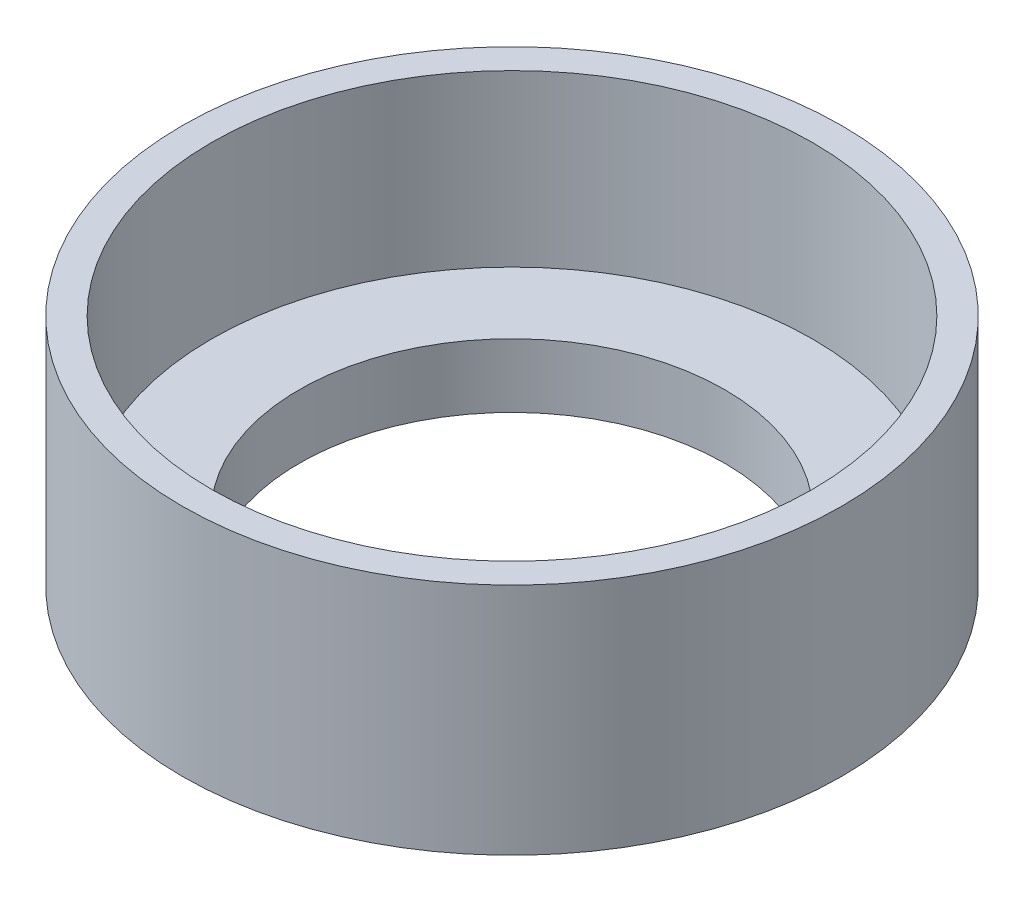
ISO-10303-21;
HEADER;
FILE_DESCRIPTION(('STEP AP214'),'2;1');
FILE_NAME('part.step','',(''),(''),'','','');
FILE_SCHEMA(('AUTOMOTIVE_DESIGN { 1 0 10303 214 1 1 1 1 }'));
ENDSEC;
DATA;
#1=APPLICATION_CONTEXT('core data for automotive mechanical design processes');
#2=APPLICATION_PROTOCOL_DEFINITION('international standard','automotive_design',2000,#1);
#3=PRODUCT_CONTEXT('',#1,'mechanical');
#4=PRODUCT('Part','Part','',(#3));
#5=PRODUCT_RELATED_PRODUCT_CATEGORY('part','',(#4));
#6=PRODUCT_DEFINITION_FORMATION('','',#4);
#7=PRODUCT_DEFINITION_CONTEXT('part definition',#1,'design');
#8=PRODUCT_DEFINITION('design','',#6,#7);
#9=PRODUCT_DEFINITION_SHAPE('','',#8);
#10=(LENGTH_UNIT() NAMED_UNIT(*) SI_UNIT(.MILLI.,.METRE.));
#11=(NAMED_UNIT(*) PLANE_ANGLE_UNIT() SI_UNIT($,.RADIAN.));
#12=(NAMED_UNIT(*) SI_UNIT($,.STERADIAN.) SOLID_ANGLE_UNIT());
#13=UNCERTAINTY_MEASURE_WITH_UNIT(LENGTH_MEASURE(1.E-05),#10,'distance_accuracy_value','');
#14=(GEOMETRIC_REPRESENTATION_CONTEXT(3) GLOBAL_UNCERTAINTY_ASSIGNED_CONTEXT((#13)) GLOBAL_UNIT_ASSIGNED_CONTEXT((#10,
#11,#12)) REPRESENTATION_CONTEXT('',''));
#15=CARTESIAN_POINT('',(0.,0.,0.));
#16=DIRECTION('',(0.,0.,1.));
#17=DIRECTION('',(1.,0.,0.));
#18=AXIS2_PLACEMENT_3D('',#15,#16,#17);
#19=CARTESIAN_POINT('',(0.,8.,0.));
#20=DIRECTION('',(0.,1.,0.));
#21=DIRECTION('',(0.,0.,1.));
#22=AXIS2_PLACEMENT_3D('',#19,#20,#21);
#23=PLANE('',#22);
#24=CARTESIAN_POINT('',(0.,8.,0.));
#25=DIRECTION('',(0.,1.,0.));
#26=DIRECTION('',(0.,0.,1.));
#27=AXIS2_PLACEMENT_3D('',#24,#25,#26);
#28=CIRCLE('',#27,15.5);
#29=CARTESIAN_POINT('',(0.,8.,15.5));
#30=VERTEX_POINT('',#29);
#31=EDGE_CURVE('E10',#30,#30,#28,.T.);
#32=ORIENTED_EDGE('',*,*,#31,.T.);
#33=EDGE_LOOP('',(#32));
#34=FACE_BOUND('',#33,.T.);
#35=CARTESIAN_POINT('',(0.,8.,0.));
#36=DIRECTION('',(0.,1.,0.));
#37=DIRECTION('',(0.,0.,1.));
#38=AXIS2_PLACEMENT_3D('',#35,#36,#37);
#39=CIRCLE('',#38,14.125);
#40=CARTESIAN_POINT('',(0.,8.,14.125));
#41=VERTEX_POINT('',#40);
#42=EDGE_CURVE('E38',#41,#41,#39,.T.);
#43=ORIENTED_EDGE('',*,*,#42,.F.);
#44=EDGE_LOOP('',(#43));
#45=FACE_BOUND('',#44,.T.);
#46=ADVANCED_FACE('F31',(#34,#45),#23,.T.);
#47=CARTESIAN_POINT('',(0.,8.,0.));
#48=DIRECTION('',(0.,-1.,0.));
#49=DIRECTION('',(0.,0.,-1.));
#50=AXIS2_PLACEMENT_3D('',#47,#48,#49);
#51=CYLINDRICAL_SURFACE('',#50,15.5);
#52=ORIENTED_EDGE('',*,*,#31,.F.);
#53=EDGE_LOOP('',(#52));
#54=FACE_BOUND('',#53,.T.);
#55=CARTESIAN_POINT('',(0.,-3.,0.));
#56=DIRECTION('',(0.,-1.,0.));
#57=DIRECTION('',(0.,0.,-1.));
#58=AXIS2_PLACEMENT_3D('',#55,#56,#57);
#59=CIRCLE('',#58,15.5);
#60=CARTESIAN_POINT('',(0.,-3.,-15.5));
#61=VERTEX_POINT('',#60);
#62=EDGE_CURVE('E47',#61,#61,#59,.T.);
#63=ORIENTED_EDGE('',*,*,#62,.F.);
#64=EDGE_LOOP('',(#63));
#65=FACE_BOUND('',#64,.T.);
#66=ADVANCED_FACE('F33',(#54,#65),#51,.T.);
#67=CARTESIAN_POINT('',(0.,8.,0.));
#68=DIRECTION('',(0.,-1.,0.));
#69=DIRECTION('',(0.,0.,-1.));
#70=AXIS2_PLACEMENT_3D('',#67,#68,#69);
#71=CYLINDRICAL_SURFACE('',#70,14.125);
#72=ORIENTED_EDGE('',*,*,#42,.T.);
#73=EDGE_LOOP('',(#72));
#74=FACE_BOUND('',#73,.T.);
#75=CARTESIAN_POINT('',(0.,0.,0.));
#76=DIRECTION('',(0.,1.,0.));
#77=DIRECTION('',(0.,0.,1.));
#78=AXIS2_PLACEMENT_3D('',#75,#76,#77);
#79=CIRCLE('',#78,14.125);
#80=CARTESIAN_POINT('',(0.,0.,14.125));
#81=VERTEX_POINT('',#80);
#82=EDGE_CURVE('E42',#81,#81,#79,.T.);
#83=ORIENTED_EDGE('',*,*,#82,.F.);
#84=EDGE_LOOP('',(#83));
#85=FACE_BOUND('',#84,.T.);
#86=ADVANCED_FACE('F71',(#74,#85),#71,.F.);
#87=CARTESIAN_POINT('',(0.,0.,0.));
#88=DIRECTION('',(0.,-1.,0.));
#89=DIRECTION('',(0.,0.,-1.));
#90=AXIS2_PLACEMENT_3D('',#87,#88,#89);
#91=PLANE('',#90);
#92=CARTESIAN_POINT('',(0.,0.,0.));
#93=DIRECTION('',(0.,-1.,0.));
#94=DIRECTION('',(0.,0.,-1.));
#95=AXIS2_PLACEMENT_3D('',#92,#93,#94);
#96=CIRCLE('',#95,10.);
#97=CARTESIAN_POINT('',(0.,0.,-10.));
#98=VERTEX_POINT('',#97);
#99=EDGE_CURVE('E52',#98,#98,#96,.T.);
#100=ORIENTED_EDGE('',*,*,#99,.T.);
#101=EDGE_LOOP('',(#100));
#102=FACE_BOUND('',#101,.T.);
#103=ORIENTED_EDGE('',*,*,#82,.T.);
#104=EDGE_LOOP('',(#103));
#105=FACE_BOUND('',#104,.T.);
#106=ADVANCED_FACE('F63',(#102,#105),#91,.F.);
#107=CARTESIAN_POINT('',(0.,-3.,0.));
#108=DIRECTION('',(0.,-1.,0.));
#109=DIRECTION('',(0.,0.,-1.));
#110=AXIS2_PLACEMENT_3D('',#107,#108,#109);
#111=PLANE('',#110);
#112=ORIENTED_EDGE('',*,*,#62,.T.);
#113=EDGE_LOOP('',(#112));
#114=FACE_BOUND('',#113,.T.);
#115=CARTESIAN_POINT('',(0.,-3.,0.));
#116=DIRECTION('',(0.,-1.,0.));
#117=DIRECTION('',(0.,0.,-1.));
#118=AXIS2_PLACEMENT_3D('',#115,#116,#117);
#119=CIRCLE('',#118,10.);
#120=CARTESIAN_POINT('',(0.,-3.,-10.));
#121=VERTEX_POINT('',#120);
#122=EDGE_CURVE('E51',#121,#121,#119,.T.);
#123=ORIENTED_EDGE('',*,*,#122,.F.);
#124=EDGE_LOOP('',(#123));
#125=FACE_BOUND('',#124,.T.);
#126=ADVANCED_FACE('F61',(#114,#125),#111,.T.);
#127=CARTESIAN_POINT('',(0.,-3.,0.));
#128=DIRECTION('',(0.,1.,0.));
#129=DIRECTION('',(0.,0.,1.));
#130=AXIS2_PLACEMENT_3D('',#127,#128,#129);
#131=CYLINDRICAL_SURFACE('',#130,10.);
#132=ORIENTED_EDGE('',*,*,#122,.T.);
#133=EDGE_LOOP('',(#132));
#134=FACE_BOUND('',#133,.T.);
#135=ORIENTED_EDGE('',*,*,#99,.F.);
#136=EDGE_LOOP('',(#135));
#137=FACE_BOUND('',#136,.T.);
#138=ADVANCED_FACE('F58',(#134,#137),#131,.F.);
#139=CLOSED_SHELL('',(#46,#66,#86,#106,#126,#138));
#140=MANIFOLD_SOLID_BREP('B2',#139);
#141=ADVANCED_BREP_SHAPE_REPRESENTATION('',(#18,#140),#14);
#142=SHAPE_DEFINITION_REPRESENTATION(#9,#141);
ENDSEC;
END-ISO-10303-21;
